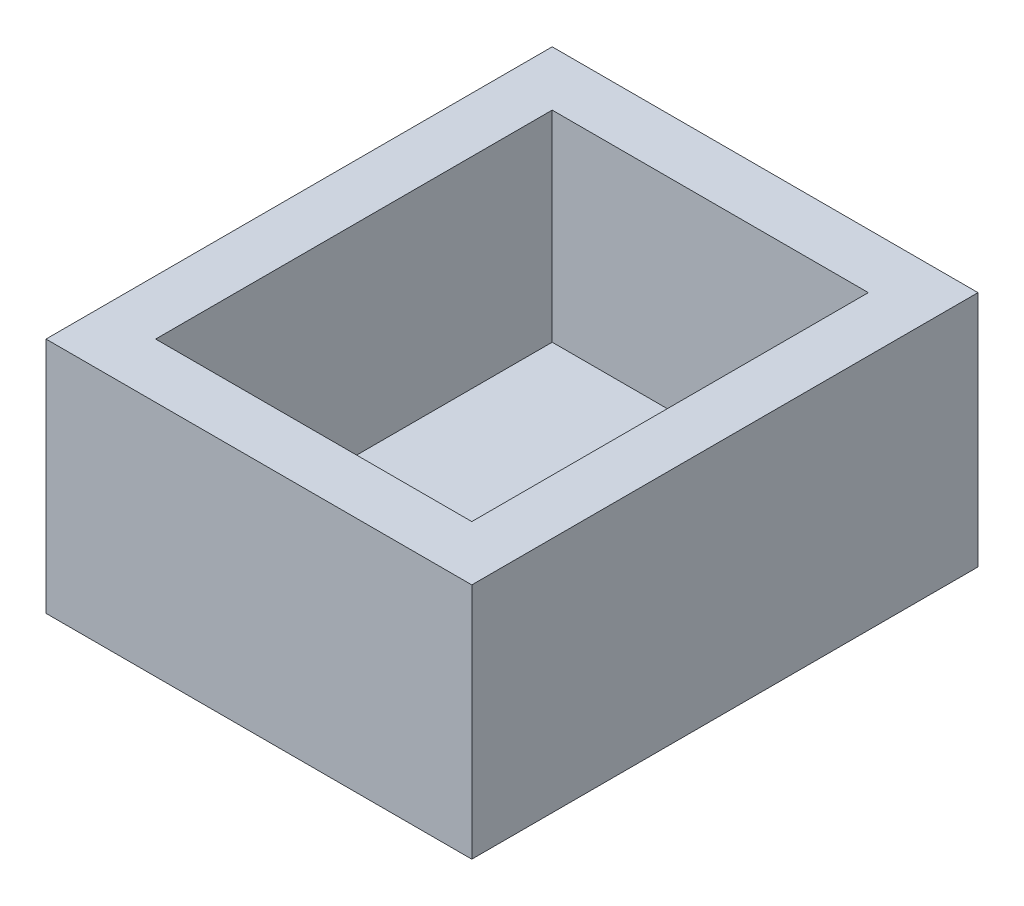
ISO-10303-21;
HEADER;
FILE_DESCRIPTION(('STEP AP214'),'2;1');
FILE_NAME('part.step','',(''),(''),'','','');
FILE_SCHEMA(('AUTOMOTIVE_DESIGN { 1 0 10303 214 1 1 1 1 }'));
ENDSEC;
DATA;
#1=APPLICATION_CONTEXT('core data for automotive mechanical design processes');
#2=APPLICATION_PROTOCOL_DEFINITION('international standard','automotive_design',2000,#1);
#3=PRODUCT_CONTEXT('',#1,'mechanical');
#4=PRODUCT('Part','Part','',(#3));
#5=PRODUCT_RELATED_PRODUCT_CATEGORY('part','',(#4));
#6=PRODUCT_DEFINITION_FORMATION('','',#4);
#7=PRODUCT_DEFINITION_CONTEXT('part definition',#1,'design');
#8=PRODUCT_DEFINITION('design','',#6,#7);
#9=PRODUCT_DEFINITION_SHAPE('','',#8);
#10=(LENGTH_UNIT() NAMED_UNIT(*) SI_UNIT(.MILLI.,.METRE.));
#11=(NAMED_UNIT(*) PLANE_ANGLE_UNIT() SI_UNIT($,.RADIAN.));
#12=(NAMED_UNIT(*) SI_UNIT($,.STERADIAN.) SOLID_ANGLE_UNIT());
#13=UNCERTAINTY_MEASURE_WITH_UNIT(LENGTH_MEASURE(1.E-05),#10,'distance_accuracy_value','');
#14=(GEOMETRIC_REPRESENTATION_CONTEXT(3) GLOBAL_UNCERTAINTY_ASSIGNED_CONTEXT((#13)) GLOBAL_UNIT_ASSIGNED_CONTEXT((#10,
#11,#12)) REPRESENTATION_CONTEXT('',''));
#15=CARTESIAN_POINT('',(0.,0.,0.));
#16=DIRECTION('',(0.,0.,1.));
#17=DIRECTION('',(1.,0.,0.));
#18=AXIS2_PLACEMENT_3D('',#15,#16,#17);
#19=CARTESIAN_POINT('',(8.65000000000002,13.,-19.8334172872565));
#20=DIRECTION('',(0.,0.,1.));
#21=DIRECTION('',(1.,0.,0.));
#22=AXIS2_PLACEMENT_3D('',#19,#20,#21);
#23=PLANE('',#22);
#24=DIRECTION('',(0.,-1.,0.));
#25=VECTOR('',#24,1.);
#26=CARTESIAN_POINT('',(-8.64999999999999,13.,-19.8334172872565));
#27=LINE('',#26,#25);
#28=CARTESIAN_POINT('',(-8.64999999999999,13.,-19.8334172872565));
#29=VERTEX_POINT('',#28);
#30=CARTESIAN_POINT('',(-8.64999999999999,2.,-19.8334172872565));
#31=VERTEX_POINT('',#30);
#32=EDGE_CURVE('E114',#29,#31,#27,.T.);
#33=ORIENTED_EDGE('',*,*,#32,.T.);
#34=DIRECTION('',(1.,0.,0.));
#35=VECTOR('',#34,1.);
#36=CARTESIAN_POINT('',(-8.64999999999999,2.,-19.8334172872565));
#37=LINE('',#36,#35);
#38=CARTESIAN_POINT('',(8.65000000000002,2.,-19.8334172872565));
#39=VERTEX_POINT('',#38);
#40=EDGE_CURVE('E100',#31,#39,#37,.T.);
#41=ORIENTED_EDGE('',*,*,#40,.T.);
#42=DIRECTION('',(0.,-1.,0.));
#43=VECTOR('',#42,1.);
#44=CARTESIAN_POINT('',(8.65000000000002,13.,-19.8334172872565));
#45=LINE('',#44,#43);
#46=CARTESIAN_POINT('',(8.65000000000002,13.,-19.8334172872565));
#47=VERTEX_POINT('',#46);
#48=EDGE_CURVE('E215',#47,#39,#45,.T.);
#49=ORIENTED_EDGE('',*,*,#48,.F.);
#50=DIRECTION('',(-1.,0.,0.));
#51=VECTOR('',#50,1.);
#52=CARTESIAN_POINT('',(8.65000000000002,13.,-19.8334172872565));
#53=LINE('',#52,#51);
#54=EDGE_CURVE('E121',#47,#29,#53,.T.);
#55=ORIENTED_EDGE('',*,*,#54,.T.);
#56=EDGE_LOOP('',(#33,#41,#49,#55));
#57=FACE_BOUND('',#56,.T.);
#58=ADVANCED_FACE('F37',(#57),#23,.T.);
#59=CARTESIAN_POINT('',(-8.64999999999999,13.,-19.8334172872565));
#60=DIRECTION('',(1.,0.,0.));
#61=DIRECTION('',(0.,0.,-1.));
#62=AXIS2_PLACEMENT_3D('',#59,#60,#61);
#63=PLANE('',#62);
#64=DIRECTION('',(0.,-1.,0.));
#65=VECTOR('',#64,1.);
#66=CARTESIAN_POINT('',(-8.64999999999999,13.,1.86658271274347));
#67=LINE('',#66,#65);
#68=CARTESIAN_POINT('',(-8.64999999999999,13.,1.86658271274347));
#69=VERTEX_POINT('',#68);
#70=CARTESIAN_POINT('',(-8.64999999999999,2.,1.86658271274347));
#71=VERTEX_POINT('',#70);
#72=EDGE_CURVE('E117',#69,#71,#67,.T.);
#73=ORIENTED_EDGE('',*,*,#72,.T.);
#74=DIRECTION('',(0.,0.,-1.));
#75=VECTOR('',#74,1.);
#76=CARTESIAN_POINT('',(-8.64999999999999,2.,1.86658271274347));
#77=LINE('',#76,#75);
#78=EDGE_CURVE('E103',#71,#31,#77,.T.);
#79=ORIENTED_EDGE('',*,*,#78,.T.);
#80=ORIENTED_EDGE('',*,*,#32,.F.);
#81=DIRECTION('',(0.,0.,1.));
#82=VECTOR('',#81,1.);
#83=CARTESIAN_POINT('',(-8.64999999999999,13.,-19.8334172872565));
#84=LINE('',#83,#82);
#85=EDGE_CURVE('E221',#29,#69,#84,.T.);
#86=ORIENTED_EDGE('',*,*,#85,.T.);
#87=EDGE_LOOP('',(#73,#79,#80,#86));
#88=FACE_BOUND('',#87,.T.);
#89=ADVANCED_FACE('F113',(#88),#63,.T.);
#90=CARTESIAN_POINT('',(-8.64999999999999,13.,1.86658271274347));
#91=DIRECTION('',(0.,0.,-1.));
#92=DIRECTION('',(-1.,0.,0.));
#93=AXIS2_PLACEMENT_3D('',#90,#91,#92);
#94=PLANE('',#93);
#95=DIRECTION('',(0.,-1.,0.));
#96=VECTOR('',#95,1.);
#97=CARTESIAN_POINT('',(8.65000000000002,13.,1.86658271274347));
#98=LINE('',#97,#96);
#99=CARTESIAN_POINT('',(8.65000000000002,13.,1.86658271274347));
#100=VERTEX_POINT('',#99);
#101=CARTESIAN_POINT('',(8.65000000000002,2.,1.86658271274347));
#102=VERTEX_POINT('',#101);
#103=EDGE_CURVE('E59',#100,#102,#98,.T.);
#104=ORIENTED_EDGE('',*,*,#103,.T.);
#105=DIRECTION('',(-1.,0.,0.));
#106=VECTOR('',#105,1.);
#107=CARTESIAN_POINT('',(-8.64999999999999,2.,1.86658271274347));
#108=LINE('',#107,#106);
#109=EDGE_CURVE('E52',#102,#71,#108,.T.);
#110=ORIENTED_EDGE('',*,*,#109,.T.);
#111=ORIENTED_EDGE('',*,*,#72,.F.);
#112=DIRECTION('',(1.,0.,0.));
#113=VECTOR('',#112,1.);
#114=CARTESIAN_POINT('',(-8.64999999999999,13.,1.86658271274347));
#115=LINE('',#114,#113);
#116=EDGE_CURVE('E213',#69,#100,#115,.T.);
#117=ORIENTED_EDGE('',*,*,#116,.T.);
#118=EDGE_LOOP('',(#104,#110,#111,#117));
#119=FACE_BOUND('',#118,.T.);
#120=ADVANCED_FACE('F184',(#119),#94,.T.);
#121=CARTESIAN_POINT('',(8.65000000000002,13.,1.86658271274347));
#122=DIRECTION('',(-1.,0.,0.));
#123=DIRECTION('',(0.,0.,1.));
#124=AXIS2_PLACEMENT_3D('',#121,#122,#123);
#125=PLANE('',#124);
#126=ORIENTED_EDGE('',*,*,#48,.T.);
#127=DIRECTION('',(0.,0.,1.));
#128=VECTOR('',#127,1.);
#129=CARTESIAN_POINT('',(8.65000000000002,2.,1.86658271274347));
#130=LINE('',#129,#128);
#131=EDGE_CURVE('E104',#39,#102,#130,.T.);
#132=ORIENTED_EDGE('',*,*,#131,.T.);
#133=ORIENTED_EDGE('',*,*,#103,.F.);
#134=DIRECTION('',(0.,0.,-1.));
#135=VECTOR('',#134,1.);
#136=CARTESIAN_POINT('',(8.65000000000002,13.,1.86658271274347));
#137=LINE('',#136,#135);
#138=EDGE_CURVE('E216',#100,#47,#137,.T.);
#139=ORIENTED_EDGE('',*,*,#138,.T.);
#140=EDGE_LOOP('',(#126,#132,#133,#139));
#141=FACE_BOUND('',#140,.T.);
#142=ADVANCED_FACE('F190',(#141),#125,.T.);
#143=CARTESIAN_POINT('',(0.,13.,0.));
#144=DIRECTION('',(0.,1.,0.));
#145=DIRECTION('',(0.,0.,1.));
#146=AXIS2_PLACEMENT_3D('',#143,#144,#145);
#147=PLANE('',#146);
#148=DIRECTION('',(-1.,0.,0.));
#149=VECTOR('',#148,1.);
#150=CARTESIAN_POINT('',(11.65,13.,-22.8334172872565));
#151=LINE('',#150,#149);
#152=CARTESIAN_POINT('',(11.65,13.,-22.8334172872565));
#153=VERTEX_POINT('',#152);
#154=CARTESIAN_POINT('',(-11.65,13.,-22.8334172872565));
#155=VERTEX_POINT('',#154);
#156=EDGE_CURVE('E130',#153,#155,#151,.T.);
#157=ORIENTED_EDGE('',*,*,#156,.T.);
#158=DIRECTION('',(0.,0.,1.));
#159=VECTOR('',#158,1.);
#160=CARTESIAN_POINT('',(-11.65,13.,-22.8334172872565));
#161=LINE('',#160,#159);
#162=CARTESIAN_POINT('',(-11.65,13.,4.86658271274347));
#163=VERTEX_POINT('',#162);
#164=EDGE_CURVE('E133',#155,#163,#161,.T.);
#165=ORIENTED_EDGE('',*,*,#164,.T.);
#166=DIRECTION('',(1.,0.,0.));
#167=VECTOR('',#166,1.);
#168=CARTESIAN_POINT('',(-11.65,13.,4.86658271274347));
#169=LINE('',#168,#167);
#170=CARTESIAN_POINT('',(11.65,13.,4.86658271274347));
#171=VERTEX_POINT('',#170);
#172=EDGE_CURVE('E136',#163,#171,#169,.T.);
#173=ORIENTED_EDGE('',*,*,#172,.T.);
#174=DIRECTION('',(0.,0.,-1.));
#175=VECTOR('',#174,1.);
#176=CARTESIAN_POINT('',(11.65,13.,4.86658271274347));
#177=LINE('',#176,#175);
#178=EDGE_CURVE('E138',#171,#153,#177,.T.);
#179=ORIENTED_EDGE('',*,*,#178,.T.);
#180=EDGE_LOOP('',(#157,#165,#173,#179));
#181=FACE_BOUND('',#180,.T.);
#182=ORIENTED_EDGE('',*,*,#85,.F.);
#183=ORIENTED_EDGE('',*,*,#54,.F.);
#184=ORIENTED_EDGE('',*,*,#138,.F.);
#185=ORIENTED_EDGE('',*,*,#116,.F.);
#186=EDGE_LOOP('',(#182,#183,#184,#185));
#187=FACE_BOUND('',#186,.T.);
#188=ADVANCED_FACE('F170',(#181,#187),#147,.T.);
#189=CARTESIAN_POINT('',(0.,0.,0.));
#190=DIRECTION('',(0.,1.,0.));
#191=DIRECTION('',(0.,0.,1.));
#192=AXIS2_PLACEMENT_3D('',#189,#190,#191);
#193=PLANE('',#192);
#194=DIRECTION('',(-1.,0.,0.));
#195=VECTOR('',#194,1.);
#196=CARTESIAN_POINT('',(11.65,0.,-22.8334172872565));
#197=LINE('',#196,#195);
#198=CARTESIAN_POINT('',(11.65,0.,-22.8334172872565));
#199=VERTEX_POINT('',#198);
#200=CARTESIAN_POINT('',(-11.65,0.,-22.8334172872565));
#201=VERTEX_POINT('',#200);
#202=EDGE_CURVE('E122',#199,#201,#197,.T.);
#203=ORIENTED_EDGE('',*,*,#202,.F.);
#204=DIRECTION('',(0.,0.,-1.));
#205=VECTOR('',#204,1.);
#206=CARTESIAN_POINT('',(11.65,0.,4.86658271274347));
#207=LINE('',#206,#205);
#208=CARTESIAN_POINT('',(11.65,0.,4.86658271274347));
#209=VERTEX_POINT('',#208);
#210=EDGE_CURVE('E134',#209,#199,#207,.T.);
#211=ORIENTED_EDGE('',*,*,#210,.F.);
#212=DIRECTION('',(1.,0.,0.));
#213=VECTOR('',#212,1.);
#214=CARTESIAN_POINT('',(-11.65,0.,4.86658271274347));
#215=LINE('',#214,#213);
#216=CARTESIAN_POINT('',(-11.65,0.,4.86658271274347));
#217=VERTEX_POINT('',#216);
#218=EDGE_CURVE('E142',#217,#209,#215,.T.);
#219=ORIENTED_EDGE('',*,*,#218,.F.);
#220=DIRECTION('',(0.,0.,1.));
#221=VECTOR('',#220,1.);
#222=CARTESIAN_POINT('',(-11.65,0.,-22.8334172872565));
#223=LINE('',#222,#221);
#224=EDGE_CURVE('E125',#201,#217,#223,.T.);
#225=ORIENTED_EDGE('',*,*,#224,.F.);
#226=EDGE_LOOP('',(#203,#211,#219,#225));
#227=FACE_BOUND('',#226,.T.);
#228=CARTESIAN_POINT('',(6.24000000000002,0.,-0.70794991168068));
#229=DIRECTION('',(0.,-1.,0.));
#230=DIRECTION('',(0.,0.,-1.));
#231=AXIS2_PLACEMENT_3D('',#228,#229,#230);
#232=CIRCLE('',#231,1.75);
#233=CARTESIAN_POINT('',(6.24000000000002,0.,-2.45794991168068));
#234=VERTEX_POINT('',#233);
#235=EDGE_CURVE('E226',#234,#234,#232,.T.);
#236=ORIENTED_EDGE('',*,*,#235,.F.);
#237=EDGE_LOOP('',(#236));
#238=FACE_BOUND('',#237,.T.);
#239=ADVANCED_FACE('F160',(#227,#238),#193,.F.);
#240=CARTESIAN_POINT('',(11.65,13.,-22.8334172872565));
#241=DIRECTION('',(0.,0.,1.));
#242=DIRECTION('',(1.,0.,0.));
#243=AXIS2_PLACEMENT_3D('',#240,#241,#242);
#244=PLANE('',#243);
#245=ORIENTED_EDGE('',*,*,#202,.T.);
#246=DIRECTION('',(0.,-1.,0.));
#247=VECTOR('',#246,1.);
#248=CARTESIAN_POINT('',(-11.65,13.,-22.8334172872565));
#249=LINE('',#248,#247);
#250=EDGE_CURVE('E11',#155,#201,#249,.T.);
#251=ORIENTED_EDGE('',*,*,#250,.F.);
#252=ORIENTED_EDGE('',*,*,#156,.F.);
#253=DIRECTION('',(0.,-1.,0.));
#254=VECTOR('',#253,1.);
#255=CARTESIAN_POINT('',(11.65,13.,-22.8334172872565));
#256=LINE('',#255,#254);
#257=EDGE_CURVE('E139',#153,#199,#256,.T.);
#258=ORIENTED_EDGE('',*,*,#257,.T.);
#259=EDGE_LOOP('',(#245,#251,#252,#258));
#260=FACE_BOUND('',#259,.T.);
#261=ADVANCED_FACE('F39',(#260),#244,.F.);
#262=CARTESIAN_POINT('',(-11.65,13.,-22.8334172872565));
#263=DIRECTION('',(1.,0.,0.));
#264=DIRECTION('',(0.,0.,-1.));
#265=AXIS2_PLACEMENT_3D('',#262,#263,#264);
#266=PLANE('',#265);
#267=ORIENTED_EDGE('',*,*,#224,.T.);
#268=DIRECTION('',(0.,-1.,0.));
#269=VECTOR('',#268,1.);
#270=CARTESIAN_POINT('',(-11.65,13.,4.86658271274347));
#271=LINE('',#270,#269);
#272=EDGE_CURVE('E45',#163,#217,#271,.T.);
#273=ORIENTED_EDGE('',*,*,#272,.F.);
#274=ORIENTED_EDGE('',*,*,#164,.F.);
#275=ORIENTED_EDGE('',*,*,#250,.T.);
#276=EDGE_LOOP('',(#267,#273,#274,#275));
#277=FACE_BOUND('',#276,.T.);
#278=ADVANCED_FACE('F172',(#277),#266,.F.);
#279=CARTESIAN_POINT('',(-11.65,13.,4.86658271274347));
#280=DIRECTION('',(0.,0.,-1.));
#281=DIRECTION('',(-1.,0.,0.));
#282=AXIS2_PLACEMENT_3D('',#279,#280,#281);
#283=PLANE('',#282);
#284=ORIENTED_EDGE('',*,*,#218,.T.);
#285=DIRECTION('',(0.,-1.,0.));
#286=VECTOR('',#285,1.);
#287=CARTESIAN_POINT('',(11.65,13.,4.86658271274347));
#288=LINE('',#287,#286);
#289=EDGE_CURVE('E147',#171,#209,#288,.T.);
#290=ORIENTED_EDGE('',*,*,#289,.F.);
#291=ORIENTED_EDGE('',*,*,#172,.F.);
#292=ORIENTED_EDGE('',*,*,#272,.T.);
#293=EDGE_LOOP('',(#284,#290,#291,#292));
#294=FACE_BOUND('',#293,.T.);
#295=ADVANCED_FACE('F154',(#294),#283,.F.);
#296=CARTESIAN_POINT('',(11.65,13.,4.86658271274347));
#297=DIRECTION('',(-1.,0.,0.));
#298=DIRECTION('',(0.,0.,1.));
#299=AXIS2_PLACEMENT_3D('',#296,#297,#298);
#300=PLANE('',#299);
#301=ORIENTED_EDGE('',*,*,#210,.T.);
#302=ORIENTED_EDGE('',*,*,#257,.F.);
#303=ORIENTED_EDGE('',*,*,#178,.F.);
#304=ORIENTED_EDGE('',*,*,#289,.T.);
#305=EDGE_LOOP('',(#301,#302,#303,#304));
#306=FACE_BOUND('',#305,.T.);
#307=ADVANCED_FACE('F164',(#306),#300,.F.);
#308=CARTESIAN_POINT('',(0.,2.,0.));
#309=DIRECTION('',(0.,-1.,0.));
#310=DIRECTION('',(0.,0.,-1.));
#311=AXIS2_PLACEMENT_3D('',#308,#309,#310);
#312=PLANE('',#311);
#313=CARTESIAN_POINT('',(6.24000000000002,2.,-0.70794991168068));
#314=DIRECTION('',(0.,-1.,0.));
#315=DIRECTION('',(0.,0.,-1.));
#316=AXIS2_PLACEMENT_3D('',#313,#314,#315);
#317=CIRCLE('',#316,1.75);
#318=CARTESIAN_POINT('',(6.24000000000002,2.,-2.45794991168068));
#319=VERTEX_POINT('',#318);
#320=EDGE_CURVE('E118',#319,#319,#317,.T.);
#321=ORIENTED_EDGE('',*,*,#320,.T.);
#322=EDGE_LOOP('',(#321));
#323=FACE_BOUND('',#322,.T.);
#324=ORIENTED_EDGE('',*,*,#78,.F.);
#325=ORIENTED_EDGE('',*,*,#109,.F.);
#326=ORIENTED_EDGE('',*,*,#131,.F.);
#327=ORIENTED_EDGE('',*,*,#40,.F.);
#328=EDGE_LOOP('',(#324,#325,#326,#327));
#329=FACE_BOUND('',#328,.T.);
#330=ADVANCED_FACE('F102',(#323,#329),#312,.F.);
#331=CARTESIAN_POINT('',(6.24000000000002,2.,-0.70794991168068));
#332=DIRECTION('',(0.,-1.,0.));
#333=DIRECTION('',(0.,0.,-1.));
#334=AXIS2_PLACEMENT_3D('',#331,#332,#333);
#335=CYLINDRICAL_SURFACE('',#334,1.75);
#336=ORIENTED_EDGE('',*,*,#320,.F.);
#337=EDGE_LOOP('',(#336));
#338=FACE_BOUND('',#337,.T.);
#339=ORIENTED_EDGE('',*,*,#235,.T.);
#340=EDGE_LOOP('',(#339));
#341=FACE_BOUND('',#340,.T.);
#342=ADVANCED_FACE('F197',(#338,#341),#335,.F.);
#343=CLOSED_SHELL('',(#58,#89,#120,#142,#188,#239,#261,#278,#295,#307,#330,#342));
#344=MANIFOLD_SOLID_BREP('B2',#343);
#345=ADVANCED_BREP_SHAPE_REPRESENTATION('',(#18,#344),#14);
#346=SHAPE_DEFINITION_REPRESENTATION(#9,#345);
ENDSEC;
END-ISO-10303-21;
